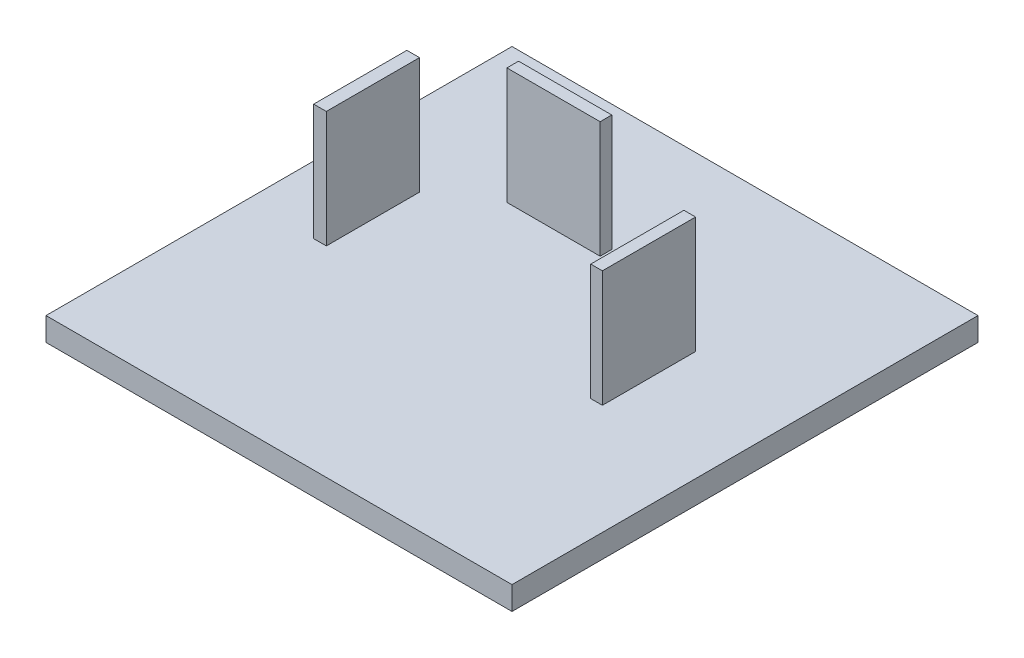
ISO-10303-21;
HEADER;
FILE_DESCRIPTION(('STEP AP214'),'2;1');
FILE_NAME('part.step','',(''),(''),'','','');
FILE_SCHEMA(('AUTOMOTIVE_DESIGN { 1 0 10303 214 1 1 1 1 }'));
ENDSEC;
DATA;
#1=APPLICATION_CONTEXT('core data for automotive mechanical design processes');
#2=APPLICATION_PROTOCOL_DEFINITION('international standard','automotive_design',2000,#1);
#3=PRODUCT_CONTEXT('',#1,'mechanical');
#4=PRODUCT('Part','Part','',(#3));
#5=PRODUCT_RELATED_PRODUCT_CATEGORY('part','',(#4));
#6=PRODUCT_DEFINITION_FORMATION('','',#4);
#7=PRODUCT_DEFINITION_CONTEXT('part definition',#1,'design');
#8=PRODUCT_DEFINITION('design','',#6,#7);
#9=PRODUCT_DEFINITION_SHAPE('','',#8);
#10=(LENGTH_UNIT() NAMED_UNIT(*) SI_UNIT(.MILLI.,.METRE.));
#11=(NAMED_UNIT(*) PLANE_ANGLE_UNIT() SI_UNIT($,.RADIAN.));
#12=(NAMED_UNIT(*) SI_UNIT($,.STERADIAN.) SOLID_ANGLE_UNIT());
#13=UNCERTAINTY_MEASURE_WITH_UNIT(LENGTH_MEASURE(1.E-05),#10,'distance_accuracy_value','');
#14=(GEOMETRIC_REPRESENTATION_CONTEXT(3) GLOBAL_UNCERTAINTY_ASSIGNED_CONTEXT((#13)) GLOBAL_UNIT_ASSIGNED_CONTEXT((#10,
#11,#12)) REPRESENTATION_CONTEXT('',''));
#15=CARTESIAN_POINT('',(0.,0.,0.));
#16=DIRECTION('',(0.,0.,1.));
#17=DIRECTION('',(1.,0.,0.));
#18=AXIS2_PLACEMENT_3D('',#15,#16,#17);
#19=CARTESIAN_POINT('',(-143.955926355845,-25.0215167619234,50.8));
#20=DIRECTION('',(0.,1.,0.));
#21=DIRECTION('',(0.,0.,1.));
#22=AXIS2_PLACEMENT_3D('',#19,#20,#21);
#23=PLANE('',#22);
#24=DIRECTION('',(1.,0.,0.));
#25=VECTOR('',#24,1.);
#26=CARTESIAN_POINT('',(-143.955926355845,-25.0215167619234,0.));
#27=LINE('',#26,#25);
#28=CARTESIAN_POINT('',(-143.955926355845,-25.0215167619234,0.));
#29=VERTEX_POINT('',#28);
#30=CARTESIAN_POINT('',(-93.1559263558452,-25.0215167619234,0.));
#31=VERTEX_POINT('',#30);
#32=EDGE_CURVE('E236',#29,#31,#27,.T.);
#33=ORIENTED_EDGE('',*,*,#32,.F.);
#34=DIRECTION('',(0.,0.,-1.));
#35=VECTOR('',#34,1.);
#36=CARTESIAN_POINT('',(-143.955926355845,-25.0215167619234,50.8));
#37=LINE('',#36,#35);
#38=CARTESIAN_POINT('',(-143.955926355845,-25.0215167619234,50.8));
#39=VERTEX_POINT('',#38);
#40=EDGE_CURVE('E244',#39,#29,#37,.T.);
#41=ORIENTED_EDGE('',*,*,#40,.F.);
#42=DIRECTION('',(1.,0.,0.));
#43=VECTOR('',#42,1.);
#44=CARTESIAN_POINT('',(-143.955926355845,-25.0215167619234,50.8));
#45=LINE('',#44,#43);
#46=CARTESIAN_POINT('',(-93.1559263558452,-25.0215167619234,50.8));
#47=VERTEX_POINT('',#46);
#48=EDGE_CURVE('E241',#39,#47,#45,.T.);
#49=ORIENTED_EDGE('',*,*,#48,.T.);
#50=DIRECTION('',(0.,0.,-1.));
#51=VECTOR('',#50,1.);
#52=CARTESIAN_POINT('',(-93.1559263558452,-25.0215167619234,50.8));
#53=LINE('',#52,#51);
#54=EDGE_CURVE('E256',#47,#31,#53,.T.);
#55=ORIENTED_EDGE('',*,*,#54,.T.);
#56=EDGE_LOOP('',(#33,#41,#49,#55));
#57=FACE_BOUND('',#56,.T.);
#58=DIRECTION('',(-1.,0.,0.));
#59=VECTOR('',#58,1.);
#60=CARTESIAN_POINT('',(-119.353948153741,-25.0215167619234,13.7255135220028));
#61=LINE('',#60,#59);
#62=CARTESIAN_POINT('',(-119.353948153741,-25.0215167619234,13.7255135220028));
#63=VERTEX_POINT('',#62);
#64=CARTESIAN_POINT('',(-129.513948153741,-25.0215167619234,13.7255135220028));
#65=VERTEX_POINT('',#64);
#66=EDGE_CURVE('E216',#63,#65,#61,.T.);
#67=ORIENTED_EDGE('',*,*,#66,.F.);
#68=DIRECTION('',(0.,0.,-1.));
#69=VECTOR('',#68,1.);
#70=CARTESIAN_POINT('',(-119.353948153741,-25.0215167619234,14.9955135220028));
#71=LINE('',#70,#69);
#72=CARTESIAN_POINT('',(-119.353948153741,-25.0215167619234,14.9955135220028));
#73=VERTEX_POINT('',#72);
#74=EDGE_CURVE('E202',#73,#63,#71,.T.);
#75=ORIENTED_EDGE('',*,*,#74,.F.);
#76=DIRECTION('',(1.,0.,0.));
#77=VECTOR('',#76,1.);
#78=CARTESIAN_POINT('',(-119.353948153741,-25.0215167619234,14.9955135220028));
#79=LINE('',#78,#77);
#80=CARTESIAN_POINT('',(-129.513948153741,-25.0215167619234,14.9955135220028));
#81=VERTEX_POINT('',#80);
#82=EDGE_CURVE('E207',#81,#73,#79,.T.);
#83=ORIENTED_EDGE('',*,*,#82,.F.);
#84=DIRECTION('',(0.,0.,1.));
#85=VECTOR('',#84,1.);
#86=CARTESIAN_POINT('',(-129.513948153741,-25.0215167619234,14.9955135220028));
#87=LINE('',#86,#85);
#88=EDGE_CURVE('E218',#65,#81,#87,.T.);
#89=ORIENTED_EDGE('',*,*,#88,.F.);
#90=EDGE_LOOP('',(#67,#75,#83,#89));
#91=FACE_BOUND('',#90,.T.);
#92=DIRECTION('',(1.,0.,0.));
#93=VECTOR('',#92,1.);
#94=CARTESIAN_POINT('',(-106.423523286495,-25.0215167619234,28.9487292878797));
#95=LINE('',#94,#93);
#96=CARTESIAN_POINT('',(-106.423523286495,-25.0215167619234,28.9487292878797));
#97=VERTEX_POINT('',#96);
#98=CARTESIAN_POINT('',(-105.153523286495,-25.0215167619234,28.9487292878797));
#99=VERTEX_POINT('',#98);
#100=EDGE_CURVE('E174',#97,#99,#95,.T.);
#101=ORIENTED_EDGE('',*,*,#100,.F.);
#102=DIRECTION('',(0.,0.,1.));
#103=VECTOR('',#102,1.);
#104=CARTESIAN_POINT('',(-106.423523286495,-25.0215167619234,18.7887292878797));
#105=LINE('',#104,#103);
#106=CARTESIAN_POINT('',(-106.423523286495,-25.0215167619234,18.7887292878797));
#107=VERTEX_POINT('',#106);
#108=EDGE_CURVE('E171',#107,#97,#105,.T.);
#109=ORIENTED_EDGE('',*,*,#108,.F.);
#110=DIRECTION('',(-1.,0.,0.));
#111=VECTOR('',#110,1.);
#112=CARTESIAN_POINT('',(-106.423523286495,-25.0215167619234,18.7887292878797));
#113=LINE('',#112,#111);
#114=CARTESIAN_POINT('',(-105.153523286495,-25.0215167619234,18.7887292878797));
#115=VERTEX_POINT('',#114);
#116=EDGE_CURVE('E183',#115,#107,#113,.T.);
#117=ORIENTED_EDGE('',*,*,#116,.F.);
#118=DIRECTION('',(0.,0.,-1.));
#119=VECTOR('',#118,1.);
#120=CARTESIAN_POINT('',(-105.153523286495,-25.0215167619234,18.7887292878797));
#121=LINE('',#120,#119);
#122=EDGE_CURVE('E191',#99,#115,#121,.T.);
#123=ORIENTED_EDGE('',*,*,#122,.F.);
#124=EDGE_LOOP('',(#101,#109,#117,#123));
#125=FACE_BOUND('',#124,.T.);
#126=DIRECTION('',(1.,0.,0.));
#127=VECTOR('',#126,1.);
#128=CARTESIAN_POINT('',(-136.627366806234,-25.0215167619234,28.9487292878797));
#129=LINE('',#128,#127);
#130=CARTESIAN_POINT('',(-136.627366806234,-25.0215167619234,28.9487292878797));
#131=VERTEX_POINT('',#130);
#132=CARTESIAN_POINT('',(-135.247864337784,-25.0215167619234,28.9487292878797));
#133=VERTEX_POINT('',#132);
#134=EDGE_CURVE('E471',#131,#133,#129,.T.);
#135=ORIENTED_EDGE('',*,*,#134,.F.);
#136=DIRECTION('',(0.,0.,1.));
#137=VECTOR('',#136,1.);
#138=CARTESIAN_POINT('',(-136.627366806234,-25.0215167619234,18.7887292878797));
#139=LINE('',#138,#137);
#140=CARTESIAN_POINT('',(-136.627366806234,-25.0215167619234,18.7887292878797));
#141=VERTEX_POINT('',#140);
#142=EDGE_CURVE('E169',#141,#131,#139,.T.);
#143=ORIENTED_EDGE('',*,*,#142,.F.);
#144=DIRECTION('',(-1.,0.,0.));
#145=VECTOR('',#144,1.);
#146=CARTESIAN_POINT('',(-136.627366806234,-25.0215167619234,18.7887292878797));
#147=LINE('',#146,#145);
#148=CARTESIAN_POINT('',(-135.247864337784,-25.0215167619234,18.7887292878797));
#149=VERTEX_POINT('',#148);
#150=EDGE_CURVE('E165',#149,#141,#147,.T.);
#151=ORIENTED_EDGE('',*,*,#150,.F.);
#152=DIRECTION('',(0.,0.,-1.));
#153=VECTOR('',#152,1.);
#154=CARTESIAN_POINT('',(-135.247864337784,-25.0215167619234,18.7887292878797));
#155=LINE('',#154,#153);
#156=EDGE_CURVE('E468',#133,#149,#155,.T.);
#157=ORIENTED_EDGE('',*,*,#156,.F.);
#158=EDGE_LOOP('',(#135,#143,#151,#157));
#159=FACE_BOUND('',#158,.T.);
#160=ADVANCED_FACE('F32',(#57,#91,#125,#159),#23,.T.);
#161=CARTESIAN_POINT('',(-143.955926355845,-25.0215167619234,50.8));
#162=DIRECTION('',(1.,0.,0.));
#163=DIRECTION('',(0.,0.,-1.));
#164=AXIS2_PLACEMENT_3D('',#161,#162,#163);
#165=PLANE('',#164);
#166=DIRECTION('',(0.,-1.,0.));
#167=VECTOR('',#166,1.);
#168=CARTESIAN_POINT('',(-143.955926355845,-25.0215167619234,0.));
#169=LINE('',#168,#167);
#170=CARTESIAN_POINT('',(-143.955926355845,-27.5615167619234,0.));
#171=VERTEX_POINT('',#170);
#172=EDGE_CURVE('E231',#29,#171,#169,.T.);
#173=ORIENTED_EDGE('',*,*,#172,.T.);
#174=DIRECTION('',(0.,0.,-1.));
#175=VECTOR('',#174,1.);
#176=CARTESIAN_POINT('',(-143.955926355845,-27.5615167619234,50.8));
#177=LINE('',#176,#175);
#178=CARTESIAN_POINT('',(-143.955926355845,-27.5615167619234,50.8));
#179=VERTEX_POINT('',#178);
#180=EDGE_CURVE('E11',#179,#171,#177,.T.);
#181=ORIENTED_EDGE('',*,*,#180,.F.);
#182=DIRECTION('',(0.,-1.,0.));
#183=VECTOR('',#182,1.);
#184=CARTESIAN_POINT('',(-143.955926355845,-25.0215167619234,50.8));
#185=LINE('',#184,#183);
#186=EDGE_CURVE('E232',#39,#179,#185,.T.);
#187=ORIENTED_EDGE('',*,*,#186,.F.);
#188=ORIENTED_EDGE('',*,*,#40,.T.);
#189=EDGE_LOOP('',(#173,#181,#187,#188));
#190=FACE_BOUND('',#189,.T.);
#191=ADVANCED_FACE('F34',(#190),#165,.F.);
#192=CARTESIAN_POINT('',(-143.955926355845,-27.5615167619234,50.8));
#193=DIRECTION('',(0.,1.,0.));
#194=DIRECTION('',(0.,0.,1.));
#195=AXIS2_PLACEMENT_3D('',#192,#193,#194);
#196=PLANE('',#195);
#197=DIRECTION('',(1.,0.,0.));
#198=VECTOR('',#197,1.);
#199=CARTESIAN_POINT('',(-143.955926355845,-27.5615167619234,0.));
#200=LINE('',#199,#198);
#201=CARTESIAN_POINT('',(-93.1559263558452,-27.5615167619234,0.));
#202=VERTEX_POINT('',#201);
#203=EDGE_CURVE('E247',#171,#202,#200,.T.);
#204=ORIENTED_EDGE('',*,*,#203,.T.);
#205=DIRECTION('',(0.,0.,-1.));
#206=VECTOR('',#205,1.);
#207=CARTESIAN_POINT('',(-93.1559263558452,-27.5615167619234,50.8));
#208=LINE('',#207,#206);
#209=CARTESIAN_POINT('',(-93.1559263558452,-27.5615167619234,50.8));
#210=VERTEX_POINT('',#209);
#211=EDGE_CURVE('E40',#210,#202,#208,.T.);
#212=ORIENTED_EDGE('',*,*,#211,.F.);
#213=DIRECTION('',(1.,0.,0.));
#214=VECTOR('',#213,1.);
#215=CARTESIAN_POINT('',(-143.955926355845,-27.5615167619234,50.8));
#216=LINE('',#215,#214);
#217=EDGE_CURVE('E235',#179,#210,#216,.T.);
#218=ORIENTED_EDGE('',*,*,#217,.F.);
#219=ORIENTED_EDGE('',*,*,#180,.T.);
#220=EDGE_LOOP('',(#204,#212,#218,#219));
#221=FACE_BOUND('',#220,.T.);
#222=ADVANCED_FACE('F263',(#221),#196,.F.);
#223=CARTESIAN_POINT('',(-93.1559263558452,-25.0215167619234,50.8));
#224=DIRECTION('',(1.,0.,0.));
#225=DIRECTION('',(0.,0.,-1.));
#226=AXIS2_PLACEMENT_3D('',#223,#224,#225);
#227=PLANE('',#226);
#228=DIRECTION('',(0.,-1.,0.));
#229=VECTOR('',#228,1.);
#230=CARTESIAN_POINT('',(-93.1559263558452,-25.0215167619234,0.));
#231=LINE('',#230,#229);
#232=EDGE_CURVE('E250',#31,#202,#231,.T.);
#233=ORIENTED_EDGE('',*,*,#232,.F.);
#234=ORIENTED_EDGE('',*,*,#54,.F.);
#235=DIRECTION('',(0.,-1.,0.));
#236=VECTOR('',#235,1.);
#237=CARTESIAN_POINT('',(-93.1559263558452,-25.0215167619234,50.8));
#238=LINE('',#237,#236);
#239=EDGE_CURVE('E238',#47,#210,#238,.T.);
#240=ORIENTED_EDGE('',*,*,#239,.T.);
#241=ORIENTED_EDGE('',*,*,#211,.T.);
#242=EDGE_LOOP('',(#233,#234,#240,#241));
#243=FACE_BOUND('',#242,.T.);
#244=ADVANCED_FACE('F260',(#243),#227,.T.);
#245=CARTESIAN_POINT('',(0.,0.,50.8));
#246=DIRECTION('',(0.,0.,1.));
#247=DIRECTION('',(1.,0.,0.));
#248=AXIS2_PLACEMENT_3D('',#245,#246,#247);
#249=PLANE('',#248);
#250=ORIENTED_EDGE('',*,*,#186,.T.);
#251=ORIENTED_EDGE('',*,*,#217,.T.);
#252=ORIENTED_EDGE('',*,*,#239,.F.);
#253=ORIENTED_EDGE('',*,*,#48,.F.);
#254=EDGE_LOOP('',(#250,#251,#252,#253));
#255=FACE_BOUND('',#254,.T.);
#256=ADVANCED_FACE('F274',(#255),#249,.T.);
#257=CARTESIAN_POINT('',(0.,0.,0.));
#258=DIRECTION('',(0.,0.,1.));
#259=DIRECTION('',(1.,0.,0.));
#260=AXIS2_PLACEMENT_3D('',#257,#258,#259);
#261=PLANE('',#260);
#262=ORIENTED_EDGE('',*,*,#172,.F.);
#263=ORIENTED_EDGE('',*,*,#32,.T.);
#264=ORIENTED_EDGE('',*,*,#232,.T.);
#265=ORIENTED_EDGE('',*,*,#203,.F.);
#266=EDGE_LOOP('',(#262,#263,#264,#265));
#267=FACE_BOUND('',#266,.T.);
#268=ADVANCED_FACE('F267',(#267),#261,.F.);
#269=CARTESIAN_POINT('',(-119.353948153741,-12.3215167619234,14.9955135220028));
#270=DIRECTION('',(-1.,0.,0.));
#271=DIRECTION('',(0.,0.,1.));
#272=AXIS2_PLACEMENT_3D('',#269,#270,#271);
#273=PLANE('',#272);
#274=ORIENTED_EDGE('',*,*,#74,.T.);
#275=DIRECTION('',(0.,-1.,0.));
#276=VECTOR('',#275,1.);
#277=CARTESIAN_POINT('',(-119.353948153741,-12.3215167619234,13.7255135220028));
#278=LINE('',#277,#276);
#279=CARTESIAN_POINT('',(-119.353948153741,-12.3215167619234,13.7255135220028));
#280=VERTEX_POINT('',#279);
#281=EDGE_CURVE('E229',#280,#63,#278,.T.);
#282=ORIENTED_EDGE('',*,*,#281,.F.);
#283=DIRECTION('',(0.,0.,-1.));
#284=VECTOR('',#283,1.);
#285=CARTESIAN_POINT('',(-119.353948153741,-12.3215167619234,14.9955135220028));
#286=LINE('',#285,#284);
#287=CARTESIAN_POINT('',(-119.353948153741,-12.3215167619234,14.9955135220028));
#288=VERTEX_POINT('',#287);
#289=EDGE_CURVE('E203',#288,#280,#286,.T.);
#290=ORIENTED_EDGE('',*,*,#289,.F.);
#291=DIRECTION('',(0.,-1.,0.));
#292=VECTOR('',#291,1.);
#293=CARTESIAN_POINT('',(-119.353948153741,-12.3215167619234,14.9955135220028));
#294=LINE('',#293,#292);
#295=EDGE_CURVE('E213',#288,#73,#294,.T.);
#296=ORIENTED_EDGE('',*,*,#295,.T.);
#297=EDGE_LOOP('',(#274,#282,#290,#296));
#298=FACE_BOUND('',#297,.T.);
#299=ADVANCED_FACE('F294',(#298),#273,.F.);
#300=CARTESIAN_POINT('',(-119.353948153741,-12.3215167619234,13.7255135220028));
#301=DIRECTION('',(0.,0.,1.));
#302=DIRECTION('',(1.,0.,0.));
#303=AXIS2_PLACEMENT_3D('',#300,#301,#302);
#304=PLANE('',#303);
#305=ORIENTED_EDGE('',*,*,#66,.T.);
#306=DIRECTION('',(0.,-1.,0.));
#307=VECTOR('',#306,1.);
#308=CARTESIAN_POINT('',(-129.513948153741,-12.3215167619234,13.7255135220028));
#309=LINE('',#308,#307);
#310=CARTESIAN_POINT('',(-129.513948153741,-12.3215167619234,13.7255135220028));
#311=VERTEX_POINT('',#310);
#312=EDGE_CURVE('E226',#311,#65,#309,.T.);
#313=ORIENTED_EDGE('',*,*,#312,.F.);
#314=DIRECTION('',(-1.,0.,0.));
#315=VECTOR('',#314,1.);
#316=CARTESIAN_POINT('',(-119.353948153741,-12.3215167619234,13.7255135220028));
#317=LINE('',#316,#315);
#318=EDGE_CURVE('E206',#280,#311,#317,.T.);
#319=ORIENTED_EDGE('',*,*,#318,.F.);
#320=ORIENTED_EDGE('',*,*,#281,.T.);
#321=EDGE_LOOP('',(#305,#313,#319,#320));
#322=FACE_BOUND('',#321,.T.);
#323=ADVANCED_FACE('F298',(#322),#304,.F.);
#324=CARTESIAN_POINT('',(-129.513948153741,-12.3215167619234,14.9955135220028));
#325=DIRECTION('',(1.,0.,0.));
#326=DIRECTION('',(0.,0.,-1.));
#327=AXIS2_PLACEMENT_3D('',#324,#325,#326);
#328=PLANE('',#327);
#329=ORIENTED_EDGE('',*,*,#88,.T.);
#330=DIRECTION('',(0.,-1.,0.));
#331=VECTOR('',#330,1.);
#332=CARTESIAN_POINT('',(-129.513948153741,-12.3215167619234,14.9955135220028));
#333=LINE('',#332,#331);
#334=CARTESIAN_POINT('',(-129.513948153741,-12.3215167619234,14.9955135220028));
#335=VERTEX_POINT('',#334);
#336=EDGE_CURVE('E224',#335,#81,#333,.T.);
#337=ORIENTED_EDGE('',*,*,#336,.F.);
#338=DIRECTION('',(0.,0.,1.));
#339=VECTOR('',#338,1.);
#340=CARTESIAN_POINT('',(-129.513948153741,-12.3215167619234,14.9955135220028));
#341=LINE('',#340,#339);
#342=EDGE_CURVE('E209',#311,#335,#341,.T.);
#343=ORIENTED_EDGE('',*,*,#342,.F.);
#344=ORIENTED_EDGE('',*,*,#312,.T.);
#345=EDGE_LOOP('',(#329,#337,#343,#344));
#346=FACE_BOUND('',#345,.T.);
#347=ADVANCED_FACE('F302',(#346),#328,.F.);
#348=CARTESIAN_POINT('',(-119.353948153741,-12.3215167619234,14.9955135220028));
#349=DIRECTION('',(0.,0.,-1.));
#350=DIRECTION('',(-1.,0.,0.));
#351=AXIS2_PLACEMENT_3D('',#348,#349,#350);
#352=PLANE('',#351);
#353=ORIENTED_EDGE('',*,*,#82,.T.);
#354=ORIENTED_EDGE('',*,*,#295,.F.);
#355=DIRECTION('',(1.,0.,0.));
#356=VECTOR('',#355,1.);
#357=CARTESIAN_POINT('',(-119.353948153741,-12.3215167619234,14.9955135220028));
#358=LINE('',#357,#356);
#359=EDGE_CURVE('E211',#335,#288,#358,.T.);
#360=ORIENTED_EDGE('',*,*,#359,.F.);
#361=ORIENTED_EDGE('',*,*,#336,.T.);
#362=EDGE_LOOP('',(#353,#354,#360,#361));
#363=FACE_BOUND('',#362,.T.);
#364=ADVANCED_FACE('F306',(#363),#352,.F.);
#365=CARTESIAN_POINT('',(0.,-12.3215167619234,0.));
#366=DIRECTION('',(0.,1.,0.));
#367=DIRECTION('',(0.,0.,1.));
#368=AXIS2_PLACEMENT_3D('',#365,#366,#367);
#369=PLANE('',#368);
#370=ORIENTED_EDGE('',*,*,#289,.T.);
#371=ORIENTED_EDGE('',*,*,#318,.T.);
#372=ORIENTED_EDGE('',*,*,#342,.T.);
#373=ORIENTED_EDGE('',*,*,#359,.T.);
#374=EDGE_LOOP('',(#370,#371,#372,#373));
#375=FACE_BOUND('',#374,.T.);
#376=ADVANCED_FACE('F310',(#375),#369,.T.);
#377=CARTESIAN_POINT('',(-106.423523286495,-12.3215167619234,18.7887292878797));
#378=DIRECTION('',(1.,0.,0.));
#379=DIRECTION('',(0.,0.,-1.));
#380=AXIS2_PLACEMENT_3D('',#377,#378,#379);
#381=PLANE('',#380);
#382=ORIENTED_EDGE('',*,*,#108,.T.);
#383=DIRECTION('',(0.,-1.,0.));
#384=VECTOR('',#383,1.);
#385=CARTESIAN_POINT('',(-106.423523286495,-12.3215167619234,28.9487292878797));
#386=LINE('',#385,#384);
#387=CARTESIAN_POINT('',(-106.423523286495,-12.3215167619234,28.9487292878797));
#388=VERTEX_POINT('',#387);
#389=EDGE_CURVE('E200',#388,#97,#386,.T.);
#390=ORIENTED_EDGE('',*,*,#389,.F.);
#391=DIRECTION('',(0.,0.,1.));
#392=VECTOR('',#391,1.);
#393=CARTESIAN_POINT('',(-106.423523286495,-12.3215167619234,18.7887292878797));
#394=LINE('',#393,#392);
#395=CARTESIAN_POINT('',(-106.423523286495,-12.3215167619234,18.7887292878797));
#396=VERTEX_POINT('',#395);
#397=EDGE_CURVE('E179',#396,#388,#394,.T.);
#398=ORIENTED_EDGE('',*,*,#397,.F.);
#399=DIRECTION('',(0.,-1.,0.));
#400=VECTOR('',#399,1.);
#401=CARTESIAN_POINT('',(-106.423523286495,-12.3215167619234,18.7887292878797));
#402=LINE('',#401,#400);
#403=EDGE_CURVE('E188',#396,#107,#402,.T.);
#404=ORIENTED_EDGE('',*,*,#403,.T.);
#405=EDGE_LOOP('',(#382,#390,#398,#404));
#406=FACE_BOUND('',#405,.T.);
#407=ADVANCED_FACE('F314',(#406),#381,.F.);
#408=CARTESIAN_POINT('',(-106.423523286495,-12.3215167619234,28.9487292878797));
#409=DIRECTION('',(0.,0.,-1.));
#410=DIRECTION('',(-1.,0.,0.));
#411=AXIS2_PLACEMENT_3D('',#408,#409,#410);
#412=PLANE('',#411);
#413=ORIENTED_EDGE('',*,*,#100,.T.);
#414=DIRECTION('',(0.,-1.,0.));
#415=VECTOR('',#414,1.);
#416=CARTESIAN_POINT('',(-105.153523286495,-12.3215167619234,28.9487292878797));
#417=LINE('',#416,#415);
#418=CARTESIAN_POINT('',(-105.153523286495,-12.3215167619234,28.9487292878797));
#419=VERTEX_POINT('',#418);
#420=EDGE_CURVE('E197',#419,#99,#417,.T.);
#421=ORIENTED_EDGE('',*,*,#420,.F.);
#422=DIRECTION('',(1.,0.,0.));
#423=VECTOR('',#422,1.);
#424=CARTESIAN_POINT('',(-106.423523286495,-12.3215167619234,28.9487292878797));
#425=LINE('',#424,#423);
#426=EDGE_CURVE('E182',#388,#419,#425,.T.);
#427=ORIENTED_EDGE('',*,*,#426,.F.);
#428=ORIENTED_EDGE('',*,*,#389,.T.);
#429=EDGE_LOOP('',(#413,#421,#427,#428));
#430=FACE_BOUND('',#429,.T.);
#431=ADVANCED_FACE('F318',(#430),#412,.F.);
#432=CARTESIAN_POINT('',(-105.153523286495,-12.3215167619234,18.7887292878797));
#433=DIRECTION('',(-1.,0.,0.));
#434=DIRECTION('',(0.,0.,1.));
#435=AXIS2_PLACEMENT_3D('',#432,#433,#434);
#436=PLANE('',#435);
#437=ORIENTED_EDGE('',*,*,#122,.T.);
#438=DIRECTION('',(0.,-1.,0.));
#439=VECTOR('',#438,1.);
#440=CARTESIAN_POINT('',(-105.153523286495,-12.3215167619234,18.7887292878797));
#441=LINE('',#440,#439);
#442=CARTESIAN_POINT('',(-105.153523286495,-12.3215167619234,18.7887292878797));
#443=VERTEX_POINT('',#442);
#444=EDGE_CURVE('E55',#443,#115,#441,.T.);
#445=ORIENTED_EDGE('',*,*,#444,.F.);
#446=DIRECTION('',(0.,0.,-1.));
#447=VECTOR('',#446,1.);
#448=CARTESIAN_POINT('',(-105.153523286495,-12.3215167619234,18.7887292878797));
#449=LINE('',#448,#447);
#450=EDGE_CURVE('E185',#419,#443,#449,.T.);
#451=ORIENTED_EDGE('',*,*,#450,.F.);
#452=ORIENTED_EDGE('',*,*,#420,.T.);
#453=EDGE_LOOP('',(#437,#445,#451,#452));
#454=FACE_BOUND('',#453,.T.);
#455=ADVANCED_FACE('F322',(#454),#436,.F.);
#456=CARTESIAN_POINT('',(-106.423523286495,-12.3215167619234,18.7887292878797));
#457=DIRECTION('',(0.,0.,1.));
#458=DIRECTION('',(1.,0.,0.));
#459=AXIS2_PLACEMENT_3D('',#456,#457,#458);
#460=PLANE('',#459);
#461=ORIENTED_EDGE('',*,*,#116,.T.);
#462=ORIENTED_EDGE('',*,*,#403,.F.);
#463=DIRECTION('',(-1.,0.,0.));
#464=VECTOR('',#463,1.);
#465=CARTESIAN_POINT('',(-106.423523286495,-12.3215167619234,18.7887292878797));
#466=LINE('',#465,#464);
#467=EDGE_CURVE('E187',#443,#396,#466,.T.);
#468=ORIENTED_EDGE('',*,*,#467,.F.);
#469=ORIENTED_EDGE('',*,*,#444,.T.);
#470=EDGE_LOOP('',(#461,#462,#468,#469));
#471=FACE_BOUND('',#470,.T.);
#472=ADVANCED_FACE('F326',(#471),#460,.F.);
#473=CARTESIAN_POINT('',(0.,-12.3215167619234,0.));
#474=DIRECTION('',(0.,1.,0.));
#475=DIRECTION('',(0.,0.,1.));
#476=AXIS2_PLACEMENT_3D('',#473,#474,#475);
#477=PLANE('',#476);
#478=ORIENTED_EDGE('',*,*,#397,.T.);
#479=ORIENTED_EDGE('',*,*,#426,.T.);
#480=ORIENTED_EDGE('',*,*,#450,.T.);
#481=ORIENTED_EDGE('',*,*,#467,.T.);
#482=EDGE_LOOP('',(#478,#479,#480,#481));
#483=FACE_BOUND('',#482,.T.);
#484=ADVANCED_FACE('F330',(#483),#477,.T.);
#485=CARTESIAN_POINT('',(-136.627366806234,-12.3215167619234,18.7887292878797));
#486=DIRECTION('',(1.,0.,0.));
#487=DIRECTION('',(0.,0.,-1.));
#488=AXIS2_PLACEMENT_3D('',#485,#486,#487);
#489=PLANE('',#488);
#490=ORIENTED_EDGE('',*,*,#142,.T.);
#491=DIRECTION('',(0.,-1.,0.));
#492=VECTOR('',#491,1.);
#493=CARTESIAN_POINT('',(-136.627366806234,-12.3215167619234,28.9487292878797));
#494=LINE('',#493,#492);
#495=CARTESIAN_POINT('',(-136.627366806234,-12.3215167619234,28.9487292878797));
#496=VERTEX_POINT('',#495);
#497=EDGE_CURVE('E150',#496,#131,#494,.T.);
#498=ORIENTED_EDGE('',*,*,#497,.F.);
#499=DIRECTION('',(0.,0.,1.));
#500=VECTOR('',#499,1.);
#501=CARTESIAN_POINT('',(-136.627366806234,-12.3215167619234,18.7887292878797));
#502=LINE('',#501,#500);
#503=CARTESIAN_POINT('',(-136.627366806234,-12.3215167619234,18.7887292878797));
#504=VERTEX_POINT('',#503);
#505=EDGE_CURVE('E157',#504,#496,#502,.T.);
#506=ORIENTED_EDGE('',*,*,#505,.F.);
#507=DIRECTION('',(0.,-1.,0.));
#508=VECTOR('',#507,1.);
#509=CARTESIAN_POINT('',(-136.627366806234,-12.3215167619234,18.7887292878797));
#510=LINE('',#509,#508);
#511=EDGE_CURVE('E465',#504,#141,#510,.T.);
#512=ORIENTED_EDGE('',*,*,#511,.T.);
#513=EDGE_LOOP('',(#490,#498,#506,#512));
#514=FACE_BOUND('',#513,.T.);
#515=ADVANCED_FACE('F167',(#514),#489,.F.);
#516=CARTESIAN_POINT('',(-136.627366806234,-12.3215167619234,28.9487292878797));
#517=DIRECTION('',(0.,0.,-1.));
#518=DIRECTION('',(-1.,0.,0.));
#519=AXIS2_PLACEMENT_3D('',#516,#517,#518);
#520=PLANE('',#519);
#521=ORIENTED_EDGE('',*,*,#134,.T.);
#522=DIRECTION('',(0.,-1.,0.));
#523=VECTOR('',#522,1.);
#524=CARTESIAN_POINT('',(-135.247864337784,-12.3215167619234,28.9487292878797));
#525=LINE('',#524,#523);
#526=CARTESIAN_POINT('',(-135.247864337784,-12.3215167619234,28.9487292878797));
#527=VERTEX_POINT('',#526);
#528=EDGE_CURVE('E153',#527,#133,#525,.T.);
#529=ORIENTED_EDGE('',*,*,#528,.F.);
#530=DIRECTION('',(1.,0.,0.));
#531=VECTOR('',#530,1.);
#532=CARTESIAN_POINT('',(-136.627366806234,-12.3215167619234,28.9487292878797));
#533=LINE('',#532,#531);
#534=EDGE_CURVE('E146',#496,#527,#533,.T.);
#535=ORIENTED_EDGE('',*,*,#534,.F.);
#536=ORIENTED_EDGE('',*,*,#497,.T.);
#537=EDGE_LOOP('',(#521,#529,#535,#536));
#538=FACE_BOUND('',#537,.T.);
#539=ADVANCED_FACE('F148',(#538),#520,.F.);
#540=CARTESIAN_POINT('',(-135.247864337784,-12.3215167619234,18.7887292878797));
#541=DIRECTION('',(-1.,0.,0.));
#542=DIRECTION('',(0.,0.,1.));
#543=AXIS2_PLACEMENT_3D('',#540,#541,#542);
#544=PLANE('',#543);
#545=ORIENTED_EDGE('',*,*,#156,.T.);
#546=DIRECTION('',(0.,-1.,0.));
#547=VECTOR('',#546,1.);
#548=CARTESIAN_POINT('',(-135.247864337784,-12.3215167619234,18.7887292878797));
#549=LINE('',#548,#547);
#550=CARTESIAN_POINT('',(-135.247864337784,-12.3215167619234,18.7887292878797));
#551=VERTEX_POINT('',#550);
#552=EDGE_CURVE('E47',#551,#149,#549,.T.);
#553=ORIENTED_EDGE('',*,*,#552,.F.);
#554=DIRECTION('',(0.,0.,-1.));
#555=VECTOR('',#554,1.);
#556=CARTESIAN_POINT('',(-135.247864337784,-12.3215167619234,18.7887292878797));
#557=LINE('',#556,#555);
#558=EDGE_CURVE('E156',#527,#551,#557,.T.);
#559=ORIENTED_EDGE('',*,*,#558,.F.);
#560=ORIENTED_EDGE('',*,*,#528,.T.);
#561=EDGE_LOOP('',(#545,#553,#559,#560));
#562=FACE_BOUND('',#561,.T.);
#563=ADVANCED_FACE('F338',(#562),#544,.F.);
#564=CARTESIAN_POINT('',(-136.627366806234,-12.3215167619234,18.7887292878797));
#565=DIRECTION('',(0.,0.,1.));
#566=DIRECTION('',(1.,0.,0.));
#567=AXIS2_PLACEMENT_3D('',#564,#565,#566);
#568=PLANE('',#567);
#569=ORIENTED_EDGE('',*,*,#150,.T.);
#570=ORIENTED_EDGE('',*,*,#511,.F.);
#571=DIRECTION('',(-1.,0.,0.));
#572=VECTOR('',#571,1.);
#573=CARTESIAN_POINT('',(-136.627366806234,-12.3215167619234,18.7887292878797));
#574=LINE('',#573,#572);
#575=EDGE_CURVE('E161',#551,#504,#574,.T.);
#576=ORIENTED_EDGE('',*,*,#575,.F.);
#577=ORIENTED_EDGE('',*,*,#552,.T.);
#578=EDGE_LOOP('',(#569,#570,#576,#577));
#579=FACE_BOUND('',#578,.T.);
#580=ADVANCED_FACE('F341',(#579),#568,.F.);
#581=CARTESIAN_POINT('',(0.,-12.3215167619234,0.));
#582=DIRECTION('',(0.,1.,0.));
#583=DIRECTION('',(0.,0.,1.));
#584=AXIS2_PLACEMENT_3D('',#581,#582,#583);
#585=PLANE('',#584);
#586=ORIENTED_EDGE('',*,*,#505,.T.);
#587=ORIENTED_EDGE('',*,*,#534,.T.);
#588=ORIENTED_EDGE('',*,*,#558,.T.);
#589=ORIENTED_EDGE('',*,*,#575,.T.);
#590=EDGE_LOOP('',(#586,#587,#588,#589));
#591=FACE_BOUND('',#590,.T.);
#592=ADVANCED_FACE('F160',(#591),#585,.T.);
#593=CLOSED_SHELL('',(#160,#191,#222,#244,#256,#268,#299,#323,#347,#364,#376,#407,#431,#455,
#472,#484,#515,#539,#563,#580,#592));
#594=MANIFOLD_SOLID_BREP('B2',#593);
#595=ADVANCED_BREP_SHAPE_REPRESENTATION('',(#18,#594),#14);
#596=SHAPE_DEFINITION_REPRESENTATION(#9,#595);
ENDSEC;
END-ISO-10303-21;
